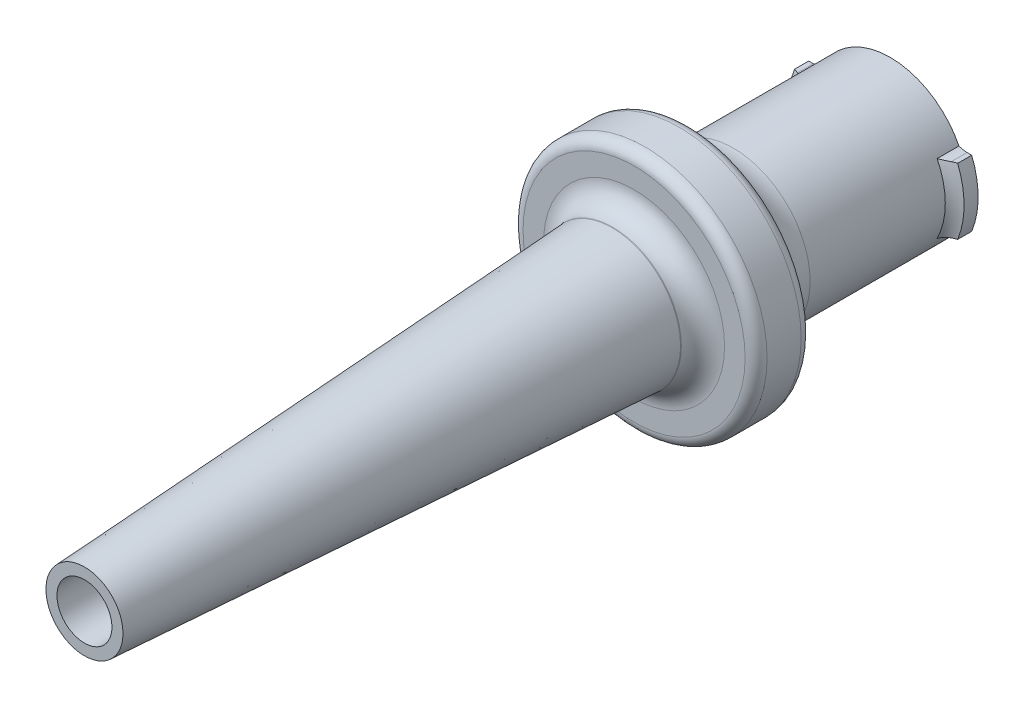
ISO-10303-21;
HEADER;
FILE_DESCRIPTION(('STEP AP214'),'2;1');
FILE_NAME('part.step','',(''),(''),'','','');
FILE_SCHEMA(('AUTOMOTIVE_DESIGN { 1 0 10303 214 1 1 1 1 }'));
ENDSEC;
DATA;
#1=APPLICATION_CONTEXT('core data for automotive mechanical design processes');
#2=APPLICATION_PROTOCOL_DEFINITION('international standard','automotive_design',2000,#1);
#3=PRODUCT_CONTEXT('',#1,'mechanical');
#4=PRODUCT('Part','Part','',(#3));
#5=PRODUCT_RELATED_PRODUCT_CATEGORY('part','',(#4));
#6=PRODUCT_DEFINITION_FORMATION('','',#4);
#7=PRODUCT_DEFINITION_CONTEXT('part definition',#1,'design');
#8=PRODUCT_DEFINITION('design','',#6,#7);
#9=PRODUCT_DEFINITION_SHAPE('','',#8);
#10=(LENGTH_UNIT() NAMED_UNIT(*) SI_UNIT(.MILLI.,.METRE.));
#11=(NAMED_UNIT(*) PLANE_ANGLE_UNIT() SI_UNIT($,.RADIAN.));
#12=(NAMED_UNIT(*) SI_UNIT($,.STERADIAN.) SOLID_ANGLE_UNIT());
#13=UNCERTAINTY_MEASURE_WITH_UNIT(LENGTH_MEASURE(1.E-05),#10,'distance_accuracy_value','');
#14=(GEOMETRIC_REPRESENTATION_CONTEXT(3) GLOBAL_UNCERTAINTY_ASSIGNED_CONTEXT((#13)) GLOBAL_UNIT_ASSIGNED_CONTEXT((#10,
#11,#12)) REPRESENTATION_CONTEXT('',''));
#15=CARTESIAN_POINT('',(0.,0.,0.));
#16=DIRECTION('',(0.,0.,1.));
#17=DIRECTION('',(1.,0.,0.));
#18=AXIS2_PLACEMENT_3D('',#15,#16,#17);
#19=CARTESIAN_POINT('',(0.,0.,12.65));
#20=DIRECTION('',(0.,0.,1.));
#21=DIRECTION('',(1.,0.,0.));
#22=AXIS2_PLACEMENT_3D('',#19,#20,#21);
#23=CYLINDRICAL_SURFACE('',#22,1.25);
#24=CARTESIAN_POINT('',(0.,0.,36.65));
#25=DIRECTION('',(0.,0.,1.));
#26=DIRECTION('',(1.,0.,0.));
#27=AXIS2_PLACEMENT_3D('',#24,#25,#26);
#28=CIRCLE('',#27,1.25);
#29=CARTESIAN_POINT('',(1.25,0.,36.65));
#30=VERTEX_POINT('',#29);
#31=EDGE_CURVE('E341',#30,#30,#28,.T.);
#32=ORIENTED_EDGE('',*,*,#31,.T.);
#33=EDGE_LOOP('',(#32));
#34=FACE_BOUND('',#33,.T.);
#35=CARTESIAN_POINT('',(0.,0.,13.));
#36=DIRECTION('',(0.,0.,-1.));
#37=DIRECTION('',(-1.,0.,0.));
#38=AXIS2_PLACEMENT_3D('',#35,#36,#37);
#39=CIRCLE('',#38,1.25);
#40=CARTESIAN_POINT('',(-1.25,0.,13.));
#41=VERTEX_POINT('',#40);
#42=EDGE_CURVE('E338',#41,#41,#39,.F.);
#43=ORIENTED_EDGE('',*,*,#42,.F.);
#44=EDGE_LOOP('',(#43));
#45=FACE_BOUND('',#44,.T.);
#46=ADVANCED_FACE('F36',(#34,#45),#23,.F.);
#47=CARTESIAN_POINT('',(0.,0.,11.65));
#48=DIRECTION('',(0.,0.,-1.));
#49=DIRECTION('',(1.,0.,0.));
#50=AXIS2_PLACEMENT_3D('',#47,#48,#49);
#51=CONICAL_SURFACE('',#50,3.15,0.0349065850398866);
#52=CARTESIAN_POINT('',(0.,0.,12.6151005032975));
#53=DIRECTION('',(0.,0.,1.));
#54=DIRECTION('',(1.,0.,0.));
#55=AXIS2_PLACEMENT_3D('',#52,#53,#54);
#56=CIRCLE('',#55,3.11629794778798);
#57=CARTESIAN_POINT('',(3.11629794778798,0.,12.6151005032975));
#58=VERTEX_POINT('',#57);
#59=EDGE_CURVE('E150',#58,#58,#56,.T.);
#60=ORIENTED_EDGE('',*,*,#59,.T.);
#61=EDGE_LOOP('',(#60));
#62=FACE_BOUND('',#61,.T.);
#63=CARTESIAN_POINT('',(0.,0.,12.65));
#64=DIRECTION('',(0.,0.,1.));
#65=DIRECTION('',(1.,0.,0.));
#66=AXIS2_PLACEMENT_3D('',#63,#64,#65);
#67=CIRCLE('',#66,3.11507923050825);
#68=CARTESIAN_POINT('',(3.11507923050825,0.,12.65));
#69=VERTEX_POINT('',#68);
#70=EDGE_CURVE('E348',#69,#69,#67,.T.);
#71=ORIENTED_EDGE('',*,*,#70,.F.);
#72=EDGE_LOOP('',(#71));
#73=FACE_BOUND('',#72,.T.);
#74=ADVANCED_FACE('F299',(#62,#73),#51,.T.);
#75=CARTESIAN_POINT('',(0.,0.,11.65));
#76=DIRECTION('',(0.,0.,1.));
#77=DIRECTION('',(1.,0.,0.));
#78=AXIS2_PLACEMENT_3D('',#75,#76,#77);
#79=PLANE('',#78);
#80=CARTESIAN_POINT('',(0.,0.,11.65));
#81=DIRECTION('',(0.,0.,1.));
#82=DIRECTION('',(1.,0.,0.));
#83=AXIS2_PLACEMENT_3D('',#80,#81,#82);
#84=CIRCLE('',#83,5.05);
#85=CARTESIAN_POINT('',(5.05,0.,11.65));
#86=VERTEX_POINT('',#85);
#87=EDGE_CURVE('E580',#86,#86,#84,.T.);
#88=ORIENTED_EDGE('',*,*,#87,.T.);
#89=EDGE_LOOP('',(#88));
#90=FACE_BOUND('',#89,.T.);
#91=CARTESIAN_POINT('',(0.,0.,11.65));
#92=DIRECTION('',(0.,0.,1.));
#93=DIRECTION('',(1.,0.,0.));
#94=AXIS2_PLACEMENT_3D('',#91,#92,#93);
#95=CIRCLE('',#94,4.11568877480708);
#96=CARTESIAN_POINT('',(4.11568877480708,0.,11.65));
#97=VERTEX_POINT('',#96);
#98=EDGE_CURVE('E585',#97,#97,#95,.F.);
#99=ORIENTED_EDGE('',*,*,#98,.T.);
#100=EDGE_LOOP('',(#99));
#101=FACE_BOUND('',#100,.T.);
#102=ADVANCED_FACE('F296',(#90,#101),#79,.T.);
#103=CARTESIAN_POINT('',(0.,1.5,0.64));
#104=DIRECTION('',(0.,-1.,0.));
#105=DIRECTION('',(1.,0.,0.));
#106=AXIS2_PLACEMENT_3D('',#103,#104,#105);
#107=PLANE('',#106);
#108=CARTESIAN_POINT('',(-3.70809924354783,1.5,0.64));
#109=CARTESIAN_POINT('',(-3.64737667205813,1.5,0.657679951316053));
#110=CARTESIAN_POINT('',(-3.58809548224564,1.5,0.680399848702581));
#111=CARTESIAN_POINT('',(-3.47390860919652,1.5,0.735387924779916));
#112=CARTESIAN_POINT('',(-3.4190177068852,1.5,0.767686765791125));
#113=CARTESIAN_POINT('',(-3.31544585192596,1.5,0.841230664962935));
#114=CARTESIAN_POINT('',(-3.26677378504799,1.5,0.882488301752746));
#115=CARTESIAN_POINT('',(-3.17759469637664,1.5,0.973008164892605));
#116=CARTESIAN_POINT('',(-3.1370786222244,1.5,1.02226140594474));
#117=CARTESIAN_POINT('',(-3.06807728624579,1.5,1.12455393615389));
#118=CARTESIAN_POINT('',(-3.03903954364431,1.5,1.17721947044101));
#119=CARTESIAN_POINT('',(-2.99144671397061,1.5,1.28706677175));
#120=CARTESIAN_POINT('',(-2.97287334553093,1.5,1.34424046246232));
#121=CARTESIAN_POINT('',(-2.9532436479617,1.5,1.43403388480849));
#122=CARTESIAN_POINT('',(-2.94805885931405,1.5,1.46579721780006));
#123=CARTESIAN_POINT('',(-2.94112879306822,1.5,1.52967914452873));
#124=CARTESIAN_POINT('',(-2.9393816875974,1.5,1.56179754033168));
#125=CARTESIAN_POINT('',(-2.93938769133994,1.5,1.59393920141697));
#126=B_SPLINE_CURVE_WITH_KNOTS('',3,(#108,#109,#110,#111,#112,#113,#114,#115,#116,#117,#118,
#119,#120,#121,#122,#123,#124,#125),.UNSPECIFIED.,.F.,.F.,(4,2,2,2,2,2,2,2,4),(0.,
0.189563466531215,0.379740400726355,0.570186100272554,0.76041924380344,0.939851108342601,
1.11896852379387,1.21535304129187,1.31168629569361),.UNSPECIFIED.);
#127=CARTESIAN_POINT('',(-3.70809924354783,1.5,0.64));
#128=VERTEX_POINT('',#127);
#129=CARTESIAN_POINT('',(-3.49857113690585,1.5,0.724151839840245));
#130=VERTEX_POINT('',#129);
#131=EDGE_CURVE('E187',#128,#130,#126,.T.);
#132=ORIENTED_EDGE('',*,*,#131,.T.);
#133=DIRECTION('',(0.,0.,-1.));
#134=VECTOR('',#133,1.);
#135=CARTESIAN_POINT('',(-3.49857113690718,1.5,0.64));
#136=LINE('',#135,#134);
#137=CARTESIAN_POINT('',(-3.49857113690718,1.5,0.));
#138=VERTEX_POINT('',#137);
#139=EDGE_CURVE('E374',#130,#138,#136,.T.);
#140=ORIENTED_EDGE('',*,*,#139,.T.);
#141=DIRECTION('',(-1.,0.,0.));
#142=VECTOR('',#141,1.);
#143=CARTESIAN_POINT('',(0.,1.5,0.));
#144=LINE('',#143,#142);
#145=CARTESIAN_POINT('',(-3.70809924354783,1.5,0.));
#146=VERTEX_POINT('',#145);
#147=EDGE_CURVE('E147',#138,#146,#144,.T.);
#148=ORIENTED_EDGE('',*,*,#147,.T.);
#149=DIRECTION('',(0.,0.,-1.));
#150=VECTOR('',#149,1.);
#151=CARTESIAN_POINT('',(-3.70809924354783,1.5,0.64));
#152=LINE('',#151,#150);
#153=EDGE_CURVE('E261',#128,#146,#152,.T.);
#154=ORIENTED_EDGE('',*,*,#153,.F.);
#155=EDGE_LOOP('',(#132,#140,#148,#154));
#156=FACE_BOUND('',#155,.T.);
#157=ADVANCED_FACE('F278',(#156),#107,.F.);
#158=CARTESIAN_POINT('',(0.,-1.5,0.64));
#159=DIRECTION('',(0.,-1.,0.));
#160=DIRECTION('',(1.,0.,0.));
#161=AXIS2_PLACEMENT_3D('',#158,#159,#160);
#162=PLANE('',#161);
#163=DIRECTION('',(-1.,0.,0.));
#164=VECTOR('',#163,1.);
#165=CARTESIAN_POINT('',(0.,-1.5,0.));
#166=LINE('',#165,#164);
#167=CARTESIAN_POINT('',(-3.49857113690718,-1.5,0.));
#168=VERTEX_POINT('',#167);
#169=CARTESIAN_POINT('',(-3.70809924354783,-1.5,0.));
#170=VERTEX_POINT('',#169);
#171=EDGE_CURVE('E251',#168,#170,#166,.T.);
#172=ORIENTED_EDGE('',*,*,#171,.F.);
#173=DIRECTION('',(0.,0.,1.));
#174=VECTOR('',#173,1.);
#175=CARTESIAN_POINT('',(-3.49857113690718,-1.5,1.59393920141695));
#176=LINE('',#175,#174);
#177=CARTESIAN_POINT('',(-3.49857113690718,-1.5,0.724151839839552));
#178=VERTEX_POINT('',#177);
#179=EDGE_CURVE('E367',#168,#178,#176,.T.);
#180=ORIENTED_EDGE('',*,*,#179,.T.);
#181=CARTESIAN_POINT('',(-2.93938769133981,-1.5,1.59393920141695));
#182=CARTESIAN_POINT('',(-2.93938571546912,-1.5,1.56781721229562));
#183=CARTESIAN_POINT('',(-2.94053765896739,-1.5,1.54170889725141));
#184=CARTESIAN_POINT('',(-2.94511887636671,-1.5,1.48970160424627));
#185=CARTESIAN_POINT('',(-2.94854737332306,-1.5,1.46380255791702));
#186=CARTESIAN_POINT('',(-2.96215986146523,-1.5,1.38690988271111));
#187=CARTESIAN_POINT('',(-2.97567150516193,-1.5,1.33646907387104));
#188=CARTESIAN_POINT('',(-3.01088785356483,-1.5,1.2386383549368));
#189=CARTESIAN_POINT('',(-3.03258513505815,-1.5,1.1912457260185));
#190=CARTESIAN_POINT('',(-3.08324366181701,-1.5,1.10049614193924));
#191=CARTESIAN_POINT('',(-3.11220966096846,-1.5,1.0571418534779));
#192=CARTESIAN_POINT('',(-3.17802550383664,-1.5,0.973209657344297));
#193=CARTESIAN_POINT('',(-3.21520602392207,-1.5,0.932891919895729));
#194=CARTESIAN_POINT('',(-3.29527356836177,-1.5,0.858348188677426));
#195=CARTESIAN_POINT('',(-3.33816567294797,-1.5,0.824127682257134));
#196=CARTESIAN_POINT('',(-3.43297836957665,-1.5,0.759282763278328));
#197=CARTESIAN_POINT('',(-3.48537244312384,-1.5,0.729350671013341));
#198=CARTESIAN_POINT('',(-3.59411743007106,-1.5,0.678107552693631));
#199=CARTESIAN_POINT('',(-3.65046170197082,-1.5,0.656782445138312));
#200=CARTESIAN_POINT('',(-3.70809924354783,-1.5,0.64));
#201=B_SPLINE_CURVE_WITH_KNOTS('',3,(#181,#182,#183,#184,#185,#186,#187,#188,#189,#190,#191,
#192,#193,#194,#195,#196,#197,#198,#199,#200),.UNSPECIFIED.,.F.,.F.,(4,2,2,2,2,2,2,2,2,4),(0.,
0.0783140176743149,0.156601321981189,0.312431311771733,0.468120324227024,0.623911426991152,
0.787773017702309,0.95178134278255,1.13204090642092,1.31200434824557),.UNSPECIFIED.);
#202=CARTESIAN_POINT('',(-3.70809924354783,-1.5,0.64));
#203=VERTEX_POINT('',#202);
#204=EDGE_CURVE('E179',#178,#203,#201,.T.);
#205=ORIENTED_EDGE('',*,*,#204,.T.);
#206=DIRECTION('',(0.,0.,-1.));
#207=VECTOR('',#206,1.);
#208=CARTESIAN_POINT('',(-3.70809924354783,-1.5,0.64));
#209=LINE('',#208,#207);
#210=EDGE_CURVE('E258',#203,#170,#209,.T.);
#211=ORIENTED_EDGE('',*,*,#210,.T.);
#212=EDGE_LOOP('',(#172,#180,#205,#211));
#213=FACE_BOUND('',#212,.T.);
#214=ADVANCED_FACE('F276',(#213),#162,.T.);
#215=CARTESIAN_POINT('',(3.70809924354783,1.5,0.));
#216=VERTEX_POINT('',#215);
#217=CARTESIAN_POINT('',(3.49857113690718,1.5,0.));
#218=VERTEX_POINT('',#217);
#219=EDGE_CURVE('E237',#216,#218,#144,.T.);
#220=ORIENTED_EDGE('',*,*,#219,.T.);
#221=DIRECTION('',(0.,0.,-1.));
#222=VECTOR('',#221,1.);
#223=CARTESIAN_POINT('',(3.49857113690718,1.5,0.64));
#224=LINE('',#223,#222);
#225=CARTESIAN_POINT('',(3.49857113690718,1.5,0.724151839839552));
#226=VERTEX_POINT('',#225);
#227=EDGE_CURVE('E357',#218,#226,#224,.F.);
#228=ORIENTED_EDGE('',*,*,#227,.T.);
#229=CARTESIAN_POINT('',(2.93938769133981,1.5,1.59393920141695));
#230=CARTESIAN_POINT('',(2.93938571546912,1.5,1.56781721229562));
#231=CARTESIAN_POINT('',(2.94053765896739,1.5,1.54170889725141));
#232=CARTESIAN_POINT('',(2.94511887636671,1.5,1.48970160424627));
#233=CARTESIAN_POINT('',(2.94854737332306,1.5,1.46380255791702));
#234=CARTESIAN_POINT('',(2.96215986146523,1.5,1.38690988271111));
#235=CARTESIAN_POINT('',(2.97567150516193,1.5,1.33646907387104));
#236=CARTESIAN_POINT('',(3.01088785356483,1.5,1.2386383549368));
#237=CARTESIAN_POINT('',(3.03258513505815,1.5,1.1912457260185));
#238=CARTESIAN_POINT('',(3.08324366181701,1.5,1.10049614193925));
#239=CARTESIAN_POINT('',(3.11220966096846,1.5,1.0571418534779));
#240=CARTESIAN_POINT('',(3.17802550383664,1.5,0.973209657344296));
#241=CARTESIAN_POINT('',(3.21520602392207,1.5,0.932891919895728));
#242=CARTESIAN_POINT('',(3.29527356836177,1.5,0.858348188677426));
#243=CARTESIAN_POINT('',(3.33816567294797,1.5,0.824127682257133));
#244=CARTESIAN_POINT('',(3.43297836957665,1.5,0.759282763278327));
#245=CARTESIAN_POINT('',(3.48537244312384,1.5,0.729350671013341));
#246=CARTESIAN_POINT('',(3.59411743007106,1.5,0.678107552693631));
#247=CARTESIAN_POINT('',(3.65046170197082,1.5,0.656782445138311));
#248=CARTESIAN_POINT('',(3.70809924354783,1.5,0.64));
#249=B_SPLINE_CURVE_WITH_KNOTS('',3,(#229,#230,#231,#232,#233,#234,#235,#236,#237,#238,#239,
#240,#241,#242,#243,#244,#245,#246,#247,#248),.UNSPECIFIED.,.F.,.F.,(4,2,2,2,2,2,2,2,2,4),(0.,
0.0783140176743151,0.156601321981189,0.312431311771733,0.468120324227024,0.623911426991152,
0.787773017702309,0.95178134278255,1.13204090642092,1.31200434824557),.UNSPECIFIED.);
#250=CARTESIAN_POINT('',(3.70809924354783,1.5,0.64));
#251=VERTEX_POINT('',#250);
#252=EDGE_CURVE('E264',#226,#251,#249,.T.);
#253=ORIENTED_EDGE('',*,*,#252,.T.);
#254=DIRECTION('',(0.,0.,-1.));
#255=VECTOR('',#254,1.);
#256=CARTESIAN_POINT('',(3.70809924354783,1.5,0.64));
#257=LINE('',#256,#255);
#258=EDGE_CURVE('E253',#251,#216,#257,.T.);
#259=ORIENTED_EDGE('',*,*,#258,.T.);
#260=EDGE_LOOP('',(#220,#228,#253,#259));
#261=FACE_BOUND('',#260,.T.);
#262=ADVANCED_FACE('F272',(#261),#107,.F.);
#263=CARTESIAN_POINT('',(0.,0.,0.64));
#264=DIRECTION('',(0.,0.,-1.));
#265=DIRECTION('',(-1.,0.,0.));
#266=AXIS2_PLACEMENT_3D('',#263,#264,#265);
#267=CYLINDRICAL_SURFACE('',#266,4.);
#268=CARTESIAN_POINT('',(0.,0.,0.));
#269=DIRECTION('',(0.,0.,1.));
#270=DIRECTION('',(1.,0.,0.));
#271=AXIS2_PLACEMENT_3D('',#268,#269,#270);
#272=CIRCLE('',#271,4.);
#273=EDGE_CURVE('E248',#146,#170,#272,.T.);
#274=ORIENTED_EDGE('',*,*,#273,.T.);
#275=ORIENTED_EDGE('',*,*,#210,.F.);
#276=CARTESIAN_POINT('',(0.,0.,0.64));
#277=DIRECTION('',(0.,0.,1.));
#278=DIRECTION('',(1.,0.,0.));
#279=AXIS2_PLACEMENT_3D('',#276,#277,#278);
#280=CIRCLE('',#279,4.);
#281=EDGE_CURVE('E242',#128,#203,#280,.T.);
#282=ORIENTED_EDGE('',*,*,#281,.F.);
#283=ORIENTED_EDGE('',*,*,#153,.T.);
#284=EDGE_LOOP('',(#274,#275,#282,#283));
#285=FACE_BOUND('',#284,.T.);
#286=ADVANCED_FACE('F275',(#285),#267,.T.);
#287=CARTESIAN_POINT('',(3.70809924354783,-1.5,0.64));
#288=CARTESIAN_POINT('',(3.64737667205813,-1.5,0.657679951316053));
#289=CARTESIAN_POINT('',(3.58809548224564,-1.5,0.680399848702581));
#290=CARTESIAN_POINT('',(3.47390860919652,-1.5,0.735387924779916));
#291=CARTESIAN_POINT('',(3.4190177068852,-1.5,0.767686765791125));
#292=CARTESIAN_POINT('',(3.31544585192596,-1.5,0.841230664962935));
#293=CARTESIAN_POINT('',(3.26677378504799,-1.5,0.882488301752746));
#294=CARTESIAN_POINT('',(3.17759469637664,-1.5,0.973008164892605));
#295=CARTESIAN_POINT('',(3.1370786222244,-1.5,1.02226140594474));
#296=CARTESIAN_POINT('',(3.06807728624579,-1.5,1.12455393615389));
#297=CARTESIAN_POINT('',(3.03903954364431,-1.5,1.17721947044101));
#298=CARTESIAN_POINT('',(2.99144671397061,-1.5,1.28706677175));
#299=CARTESIAN_POINT('',(2.97287334553093,-1.5,1.34424046246232));
#300=CARTESIAN_POINT('',(2.9532436479617,-1.5,1.43403388480849));
#301=CARTESIAN_POINT('',(2.94805885931405,-1.5,1.46579721780006));
#302=CARTESIAN_POINT('',(2.94112879306822,-1.5,1.52967914452873));
#303=CARTESIAN_POINT('',(2.9393816875974,-1.5,1.56179754033168));
#304=CARTESIAN_POINT('',(2.93938769133994,-1.5,1.59393920141697));
#305=B_SPLINE_CURVE_WITH_KNOTS('',3,(#287,#288,#289,#290,#291,#292,#293,#294,#295,#296,#297,
#298,#299,#300,#301,#302,#303,#304),.UNSPECIFIED.,.F.,.F.,(4,2,2,2,2,2,2,2,4),(0.,
0.189563466531215,0.379740400726355,0.570186100272554,0.760419243803441,0.939851108342601,
1.11896852379387,1.21535304129187,1.31168629569362),.UNSPECIFIED.);
#306=CARTESIAN_POINT('',(3.70809924354783,-1.5,0.64));
#307=VERTEX_POINT('',#306);
#308=CARTESIAN_POINT('',(3.49857113690585,-1.5,0.724151839840245));
#309=VERTEX_POINT('',#308);
#310=EDGE_CURVE('E268',#307,#309,#305,.T.);
#311=ORIENTED_EDGE('',*,*,#310,.T.);
#312=DIRECTION('',(0.,0.,1.));
#313=VECTOR('',#312,1.);
#314=CARTESIAN_POINT('',(3.49857113690718,-1.5,0.));
#315=LINE('',#314,#313);
#316=CARTESIAN_POINT('',(3.49857113690718,-1.5,0.));
#317=VERTEX_POINT('',#316);
#318=EDGE_CURVE('E233',#309,#317,#315,.F.);
#319=ORIENTED_EDGE('',*,*,#318,.T.);
#320=CARTESIAN_POINT('',(3.70809924354783,-1.5,0.));
#321=VERTEX_POINT('',#320);
#322=EDGE_CURVE('E229',#321,#317,#166,.T.);
#323=ORIENTED_EDGE('',*,*,#322,.F.);
#324=DIRECTION('',(0.,0.,-1.));
#325=VECTOR('',#324,1.);
#326=CARTESIAN_POINT('',(3.70809924354783,-1.5,0.64));
#327=LINE('',#326,#325);
#328=EDGE_CURVE('E256',#307,#321,#327,.T.);
#329=ORIENTED_EDGE('',*,*,#328,.F.);
#330=EDGE_LOOP('',(#311,#319,#323,#329));
#331=FACE_BOUND('',#330,.T.);
#332=ADVANCED_FACE('F279',(#331),#162,.T.);
#333=EDGE_CURVE('E245',#321,#216,#272,.T.);
#334=ORIENTED_EDGE('',*,*,#333,.T.);
#335=ORIENTED_EDGE('',*,*,#258,.F.);
#336=EDGE_CURVE('E244',#307,#251,#280,.T.);
#337=ORIENTED_EDGE('',*,*,#336,.F.);
#338=ORIENTED_EDGE('',*,*,#328,.T.);
#339=EDGE_LOOP('',(#334,#335,#337,#338));
#340=FACE_BOUND('',#339,.T.);
#341=ADVANCED_FACE('F284',(#340),#267,.T.);
#342=CARTESIAN_POINT('',(0.,0.,0.));
#343=DIRECTION('',(0.,0.,1.));
#344=DIRECTION('',(1.,0.,0.));
#345=AXIS2_PLACEMENT_3D('',#342,#343,#344);
#346=PLANE('',#345);
#347=CARTESIAN_POINT('',(3.49857113690718,-2.5,0.));
#348=DIRECTION('',(0.,0.,1.));
#349=DIRECTION('',(1.,0.,0.));
#350=AXIS2_PLACEMENT_3D('',#347,#348,#349);
#351=CIRCLE('',#350,1.);
#352=CARTESIAN_POINT('',(3.12739192469194,-1.57143875139048,0.));
#353=VERTEX_POINT('',#352);
#354=EDGE_CURVE('E207',#317,#353,#351,.T.);
#355=ORIENTED_EDGE('',*,*,#354,.T.);
#356=CARTESIAN_POINT('',(0.,0.,0.));
#357=DIRECTION('',(0.,0.,-1.));
#358=DIRECTION('',(-1.,0.,0.));
#359=AXIS2_PLACEMENT_3D('',#356,#357,#358);
#360=CIRCLE('',#359,3.5);
#361=CARTESIAN_POINT('',(-3.12739192469194,-1.57143875139048,0.));
#362=VERTEX_POINT('',#361);
#363=EDGE_CURVE('E136',#353,#362,#360,.T.);
#364=ORIENTED_EDGE('',*,*,#363,.T.);
#365=CARTESIAN_POINT('',(-3.49857113690718,-2.5,0.));
#366=DIRECTION('',(0.,0.,1.));
#367=DIRECTION('',(1.,0.,0.));
#368=AXIS2_PLACEMENT_3D('',#365,#366,#367);
#369=CIRCLE('',#368,1.);
#370=EDGE_CURVE('E201',#362,#168,#369,.T.);
#371=ORIENTED_EDGE('',*,*,#370,.T.);
#372=ORIENTED_EDGE('',*,*,#171,.T.);
#373=ORIENTED_EDGE('',*,*,#273,.F.);
#374=ORIENTED_EDGE('',*,*,#147,.F.);
#375=CARTESIAN_POINT('',(-3.49857113690718,2.5,0.));
#376=DIRECTION('',(0.,0.,1.));
#377=DIRECTION('',(1.,0.,0.));
#378=AXIS2_PLACEMENT_3D('',#375,#376,#377);
#379=CIRCLE('',#378,1.);
#380=CARTESIAN_POINT('',(-3.12739192469194,1.57143875139048,0.));
#381=VERTEX_POINT('',#380);
#382=EDGE_CURVE('E51',#138,#381,#379,.T.);
#383=ORIENTED_EDGE('',*,*,#382,.T.);
#384=CARTESIAN_POINT('',(3.12739192469194,1.57143875139048,0.));
#385=VERTEX_POINT('',#384);
#386=EDGE_CURVE('E128',#381,#385,#360,.T.);
#387=ORIENTED_EDGE('',*,*,#386,.T.);
#388=CARTESIAN_POINT('',(3.49857113690718,2.5,0.));
#389=DIRECTION('',(0.,0.,1.));
#390=DIRECTION('',(1.,0.,0.));
#391=AXIS2_PLACEMENT_3D('',#388,#389,#390);
#392=CIRCLE('',#391,1.);
#393=EDGE_CURVE('E148',#385,#218,#392,.T.);
#394=ORIENTED_EDGE('',*,*,#393,.T.);
#395=ORIENTED_EDGE('',*,*,#219,.F.);
#396=ORIENTED_EDGE('',*,*,#333,.F.);
#397=ORIENTED_EDGE('',*,*,#322,.T.);
#398=EDGE_LOOP('',(#355,#364,#371,#372,#373,#374,#383,#387,#394,#395,#396,#397));
#399=FACE_BOUND('',#398,.T.);
#400=CARTESIAN_POINT('',(0.,0.,0.));
#401=DIRECTION('',(0.,0.,-1.));
#402=DIRECTION('',(-1.,0.,0.));
#403=AXIS2_PLACEMENT_3D('',#400,#401,#402);
#404=CIRCLE('',#403,2.5);
#405=CARTESIAN_POINT('',(-2.5,0.,0.));
#406=VERTEX_POINT('',#405);
#407=EDGE_CURVE('E349',#406,#406,#404,.T.);
#408=ORIENTED_EDGE('',*,*,#407,.F.);
#409=EDGE_LOOP('',(#408));
#410=FACE_BOUND('',#409,.T.);
#411=ADVANCED_FACE('F144',(#399,#410),#346,.F.);
#412=CARTESIAN_POINT('',(0.,0.,11.65));
#413=DIRECTION('',(0.,0.,-1.));
#414=DIRECTION('',(-1.,0.,0.));
#415=AXIS2_PLACEMENT_3D('',#412,#413,#414);
#416=CYLINDRICAL_SURFACE('',#415,5.55);
#417=CARTESIAN_POINT('',(0.,0.,11.15));
#418=DIRECTION('',(0.,0.,1.));
#419=DIRECTION('',(1.,0.,0.));
#420=AXIS2_PLACEMENT_3D('',#417,#418,#419);
#421=CIRCLE('',#420,5.55);
#422=CARTESIAN_POINT('',(5.55,0.,11.15));
#423=VERTEX_POINT('',#422);
#424=EDGE_CURVE('E140',#423,#423,#421,.F.);
#425=ORIENTED_EDGE('',*,*,#424,.T.);
#426=EDGE_LOOP('',(#425));
#427=FACE_BOUND('',#426,.T.);
#428=CARTESIAN_POINT('',(0.,0.,9.6));
#429=DIRECTION('',(0.,0.,1.));
#430=DIRECTION('',(1.,0.,0.));
#431=AXIS2_PLACEMENT_3D('',#428,#429,#430);
#432=CIRCLE('',#431,5.55);
#433=CARTESIAN_POINT('',(5.55,0.,9.6));
#434=VERTEX_POINT('',#433);
#435=EDGE_CURVE('E578',#434,#434,#432,.T.);
#436=ORIENTED_EDGE('',*,*,#435,.T.);
#437=EDGE_LOOP('',(#436));
#438=FACE_BOUND('',#437,.T.);
#439=ADVANCED_FACE('F292',(#427,#438),#416,.T.);
#440=CARTESIAN_POINT('',(0.,0.,1.59393920141695));
#441=DIRECTION('',(0.,0.,-1.));
#442=DIRECTION('',(-1.,0.,0.));
#443=AXIS2_PLACEMENT_3D('',#440,#441,#442);
#444=TOROIDAL_SURFACE('',#443,4.3,1.);
#445=CARTESIAN_POINT('',(3.49857113690718,1.5,0.724151839839552));
#446=CARTESIAN_POINT('',(3.46813238076463,1.50000371026191,0.740022002745085));
#447=CARTESIAN_POINT('',(3.43832885012181,1.50138889751431,0.757002467372123));
#448=CARTESIAN_POINT('',(3.38016749193705,1.50660567330888,0.792807090686246));
#449=CARTESIAN_POINT('',(3.35180631994227,1.51043129499536,0.811626657997318));
#450=CARTESIAN_POINT('',(3.2694823168231,1.5250097539399,0.870014868642405));
#451=CARTESIAN_POINT('',(3.217668472291,1.53887712505026,0.911843001837392));
#452=CARTESIAN_POINT('',(3.1001483457144,1.57990816679971,1.01723049055714));
#453=CARTESIAN_POINT('',(3.03732643341468,1.61018312501245,1.08272491751646));
#454=CARTESIAN_POINT('',(2.92216470450621,1.68005660911412,1.21818023460511));
#455=CARTESIAN_POINT('',(2.86987358127555,1.71969668424737,1.28815998587926));
#456=CARTESIAN_POINT('',(2.79719714460234,1.78637992885264,1.3970891145051));
#457=CARTESIAN_POINT('',(2.77325880206341,1.81074362010599,1.43538411133335));
#458=CARTESIAN_POINT('',(2.72821355060894,1.86148701447727,1.51218320861839));
#459=CARTESIAN_POINT('',(2.70710087479049,1.88786243353957,1.55068671100862));
#460=CARTESIAN_POINT('',(2.68656761926378,1.91634581692431,1.59076771051939));
#461=CARTESIAN_POINT('',(2.68575759968316,1.91747440336897,1.59235346830425));
#462=CARTESIAN_POINT('',(2.6849499422776,1.91860465116279,1.59393920141695));
#463=B_SPLINE_CURVE_WITH_KNOTS('',3,(#445,#446,#447,#448,#449,#450,#451,#452,#453,#454,#455,
#456,#457,#458,#459,#460,#461,#462),.UNSPECIFIED.,.F.,.F.,(4,2,2,2,2,2,2,2,4),(0.,
0.102854308744296,0.205458097838275,0.408615458041143,0.69413860693505,0.980953117040051,
1.13480324458699,1.28833442888432,1.29465899016649),.UNSPECIFIED.);
#464=CARTESIAN_POINT('',(3.12739192469194,1.57143875139048,0.993939201403987));
#465=VERTEX_POINT('',#464);
#466=EDGE_CURVE('E152',#226,#465,#463,.T.);
#467=ORIENTED_EDGE('',*,*,#466,.T.);
#468=CARTESIAN_POINT('',(0.,0.,0.993939201416945));
#469=DIRECTION('',(0.,0.,1.));
#470=DIRECTION('',(1.,0.,0.));
#471=AXIS2_PLACEMENT_3D('',#468,#469,#470);
#472=CIRCLE('',#471,3.5);
#473=CARTESIAN_POINT('',(3.12739192469194,-1.57143875139048,0.993939201416945));
#474=VERTEX_POINT('',#473);
#475=EDGE_CURVE('E235',#465,#474,#472,.F.);
#476=ORIENTED_EDGE('',*,*,#475,.T.);
#477=CARTESIAN_POINT('',(3.49857113690718,-1.5,0.724151839840245));
#478=CARTESIAN_POINT('',(3.46813238076444,-1.50000371026192,0.74002200274545));
#479=CARTESIAN_POINT('',(3.43832885012154,-1.50138889751433,0.757002467372354));
#480=CARTESIAN_POINT('',(3.38016749193673,-1.50660567330891,0.792807090686382));
#481=CARTESIAN_POINT('',(3.35180631994197,-1.5104312949954,0.811626657997493));
#482=CARTESIAN_POINT('',(3.26948231682286,-1.52500975393996,0.87001486864265));
#483=CARTESIAN_POINT('',(3.21766847229075,-1.53887712505034,0.911843001837619));
#484=CARTESIAN_POINT('',(3.10014834571414,-1.57990816679982,1.01723049055737));
#485=CARTESIAN_POINT('',(3.03732643341441,-1.6101831250126,1.0827249175167));
#486=CARTESIAN_POINT('',(2.92216470450598,-1.68005660911427,1.21818023460547));
#487=CARTESIAN_POINT('',(2.86987358127537,-1.71969668424748,1.28815998587971));
#488=CARTESIAN_POINT('',(2.79719714460211,-1.78637992885288,1.39708911450536));
#489=CARTESIAN_POINT('',(2.77325880206315,-1.8107436201063,1.43538411133343));
#490=CARTESIAN_POINT('',(2.72821355060898,-1.8614870144772,1.51218320861867));
#491=CARTESIAN_POINT('',(2.70710087479085,-1.88786243353907,1.55068671100927));
#492=CARTESIAN_POINT('',(2.68656761926381,-1.91634581692427,1.59076771051944));
#493=CARTESIAN_POINT('',(2.68575759968318,-1.91747440336895,1.59235346830428));
#494=CARTESIAN_POINT('',(2.6849499422776,-1.91860465116279,1.59393920141695));
#495=B_SPLINE_CURVE_WITH_KNOTS('',3,(#477,#478,#479,#480,#481,#482,#483,#484,#485,#486,#487,
#488,#489,#490,#491,#492,#493,#494),.UNSPECIFIED.,.F.,.F.,(4,2,2,2,2,2,2,2,4),(0.,
0.102854308744308,0.205458097838278,0.408615458041137,0.694138606935125,0.980953117040202,
1.13480324458689,1.28833442888398,1.29465899016615),.UNSPECIFIED.);
#496=EDGE_CURVE('E200',#474,#309,#495,.F.);
#497=ORIENTED_EDGE('',*,*,#496,.T.);
#498=ORIENTED_EDGE('',*,*,#310,.F.);
#499=ORIENTED_EDGE('',*,*,#336,.T.);
#500=ORIENTED_EDGE('',*,*,#252,.F.);
#501=EDGE_LOOP('',(#467,#476,#497,#498,#499,#500));
#502=FACE_BOUND('',#501,.T.);
#503=ADVANCED_FACE('F171',(#502),#444,.F.);
#504=CARTESIAN_POINT('',(0.,0.,1.59393920141695));
#505=DIRECTION('',(0.,0.,-1.));
#506=DIRECTION('',(-1.,0.,0.));
#507=AXIS2_PLACEMENT_3D('',#504,#505,#506);
#508=TOROIDAL_SURFACE('',#507,4.3,1.);
#509=CARTESIAN_POINT('',(-3.49857113690718,-1.5,0.724151839839552));
#510=CARTESIAN_POINT('',(-3.46813238076464,-1.50000371026191,0.740022002745084));
#511=CARTESIAN_POINT('',(-3.43832885012182,-1.50138889751431,0.75700246737212));
#512=CARTESIAN_POINT('',(-3.38016749193706,-1.50660567330888,0.792807090686238));
#513=CARTESIAN_POINT('',(-3.35180631994228,-1.51043129499536,0.811626657997308));
#514=CARTESIAN_POINT('',(-3.26948231682312,-1.5250097539399,0.870014868642398));
#515=CARTESIAN_POINT('',(-3.217668472291,-1.53887712505026,0.911843001837391));
#516=CARTESIAN_POINT('',(-3.10014834571439,-1.57990816679971,1.01723049055714));
#517=CARTESIAN_POINT('',(-3.03732643341466,-1.61018312501247,1.08272491751644));
#518=CARTESIAN_POINT('',(-2.92216470450622,-1.6800566091141,1.21818023460515));
#519=CARTESIAN_POINT('',(-2.86987358127562,-1.71969668424728,1.28815998587937));
#520=CARTESIAN_POINT('',(-2.79719714460231,-1.78637992885269,1.39708911450505));
#521=CARTESIAN_POINT('',(-2.7732588020633,-1.81074362010613,1.43538411133319));
#522=CARTESIAN_POINT('',(-2.72821355060905,-1.86148701447712,1.51218320861855));
#523=CARTESIAN_POINT('',(-2.70710087479088,-1.88786243353903,1.5506867110092));
#524=CARTESIAN_POINT('',(-2.68656761926381,-1.91634581692427,1.59076771051944));
#525=CARTESIAN_POINT('',(-2.68575759968317,-1.91747440336895,1.59235346830428));
#526=CARTESIAN_POINT('',(-2.6849499422776,-1.91860465116279,1.59393920141695));
#527=B_SPLINE_CURVE_WITH_KNOTS('',3,(#509,#510,#511,#512,#513,#514,#515,#516,#517,#518,#519,
#520,#521,#522,#523,#524,#525,#526),.UNSPECIFIED.,.F.,.F.,(4,2,2,2,2,2,2,2,4),(0.,
0.102854308744286,0.205458097838253,0.408615458041143,0.69413860693506,0.980953117040049,
1.13480324458699,1.28833442888432,1.29465899016649),.UNSPECIFIED.);
#528=CARTESIAN_POINT('',(-3.12739192469194,-1.57143875139048,0.993939201416945));
#529=VERTEX_POINT('',#528);
#530=EDGE_CURVE('E193',#178,#529,#527,.T.);
#531=ORIENTED_EDGE('',*,*,#530,.T.);
#532=CARTESIAN_POINT('',(0.,0.,0.993939201416945));
#533=DIRECTION('',(0.,0.,1.));
#534=DIRECTION('',(1.,0.,0.));
#535=AXIS2_PLACEMENT_3D('',#532,#533,#534);
#536=CIRCLE('',#535,3.5);
#537=CARTESIAN_POINT('',(-3.12739192469194,1.57143875139048,0.993939201403405));
#538=VERTEX_POINT('',#537);
#539=EDGE_CURVE('E135',#529,#538,#536,.F.);
#540=ORIENTED_EDGE('',*,*,#539,.T.);
#541=CARTESIAN_POINT('',(-3.49857113690718,1.5,0.724151839840245));
#542=CARTESIAN_POINT('',(-3.46813238076443,1.50000371026192,0.740022002745453));
#543=CARTESIAN_POINT('',(-3.43832885012152,1.50138889751433,0.757002467372362));
#544=CARTESIAN_POINT('',(-3.3801674919367,1.50660567330891,0.792807090686401));
#545=CARTESIAN_POINT('',(-3.35180631994194,1.51043129499541,0.811626657997519));
#546=CARTESIAN_POINT('',(-3.26948231682283,1.52500975393997,0.870014868642669));
#547=CARTESIAN_POINT('',(-3.21766847229073,1.53887712505035,0.91184300183762));
#548=CARTESIAN_POINT('',(-3.10014834571415,1.5799081667998,1.01723049055737));
#549=CARTESIAN_POINT('',(-3.03732643341447,1.61018312501254,1.08272491751675));
#550=CARTESIAN_POINT('',(-2.92216470450595,1.68005660911432,1.21818023460539));
#551=CARTESIAN_POINT('',(-2.86987358127522,1.7196966842477,1.28815998587946));
#552=CARTESIAN_POINT('',(-2.7971971446022,1.78637992885276,1.39708911450549));
#553=CARTESIAN_POINT('',(-2.77325880206341,1.81074362010594,1.43538411133381));
#554=CARTESIAN_POINT('',(-2.72821355060873,1.86148701447755,1.51218320861829));
#555=CARTESIAN_POINT('',(-2.70710087478993,1.88786243354035,1.55068671100788));
#556=CARTESIAN_POINT('',(-2.68656761926374,1.91634581692437,1.59076771051932));
#557=CARTESIAN_POINT('',(-2.68575759968314,1.917474403369,1.59235346830422));
#558=CARTESIAN_POINT('',(-2.6849499422776,1.91860465116279,1.59393920141695));
#559=B_SPLINE_CURVE_WITH_KNOTS('',3,(#541,#542,#543,#544,#545,#546,#547,#548,#549,#550,#551,
#552,#553,#554,#555,#556,#557,#558),.UNSPECIFIED.,.F.,.F.,(4,2,2,2,2,2,2,2,4),(0.,
0.102854308744334,0.205458097838331,0.408615458041137,0.694138606935095,0.980953117040202,
1.1348032445869,1.28833442888398,1.29465899016615),.UNSPECIFIED.);
#560=EDGE_CURVE('E59',#538,#130,#559,.F.);
#561=ORIENTED_EDGE('',*,*,#560,.T.);
#562=ORIENTED_EDGE('',*,*,#131,.F.);
#563=ORIENTED_EDGE('',*,*,#281,.T.);
#564=ORIENTED_EDGE('',*,*,#204,.F.);
#565=EDGE_LOOP('',(#531,#540,#561,#562,#563,#564));
#566=FACE_BOUND('',#565,.T.);
#567=ADVANCED_FACE('F165',(#566),#508,.F.);
#568=CARTESIAN_POINT('',(-3.49857113690718,-2.5,9.1));
#569=DIRECTION('',(0.,0.,-1.));
#570=DIRECTION('',(-1.,0.,0.));
#571=AXIS2_PLACEMENT_3D('',#568,#569,#570);
#572=CYLINDRICAL_SURFACE('',#571,1.);
#573=ORIENTED_EDGE('',*,*,#370,.F.);
#574=DIRECTION('',(0.,0.,-1.));
#575=VECTOR('',#574,1.);
#576=CARTESIAN_POINT('',(-3.12739192469194,-1.57143875139048,4.5));
#577=LINE('',#576,#575);
#578=EDGE_CURVE('E353',#362,#529,#577,.F.);
#579=ORIENTED_EDGE('',*,*,#578,.T.);
#580=ORIENTED_EDGE('',*,*,#530,.F.);
#581=ORIENTED_EDGE('',*,*,#179,.F.);
#582=EDGE_LOOP('',(#573,#579,#580,#581));
#583=FACE_BOUND('',#582,.T.);
#584=ADVANCED_FACE('F170',(#583),#572,.F.);
#585=CARTESIAN_POINT('',(3.49857113690718,-2.5,9.1));
#586=DIRECTION('',(0.,0.,-1.));
#587=DIRECTION('',(-1.,0.,0.));
#588=AXIS2_PLACEMENT_3D('',#585,#586,#587);
#589=CYLINDRICAL_SURFACE('',#588,1.);
#590=ORIENTED_EDGE('',*,*,#496,.F.);
#591=DIRECTION('',(0.,0.,-1.));
#592=VECTOR('',#591,1.);
#593=CARTESIAN_POINT('',(3.12739192469194,-1.57143875139048,4.5));
#594=LINE('',#593,#592);
#595=EDGE_CURVE('E234',#474,#353,#594,.T.);
#596=ORIENTED_EDGE('',*,*,#595,.T.);
#597=ORIENTED_EDGE('',*,*,#354,.F.);
#598=ORIENTED_EDGE('',*,*,#318,.F.);
#599=EDGE_LOOP('',(#590,#596,#597,#598));
#600=FACE_BOUND('',#599,.T.);
#601=ADVANCED_FACE('F208',(#600),#589,.F.);
#602=CARTESIAN_POINT('',(3.49857113690718,2.5,9.1));
#603=DIRECTION('',(0.,0.,-1.));
#604=DIRECTION('',(-1.,0.,0.));
#605=AXIS2_PLACEMENT_3D('',#602,#603,#604);
#606=CYLINDRICAL_SURFACE('',#605,1.);
#607=ORIENTED_EDGE('',*,*,#393,.F.);
#608=DIRECTION('',(0.,0.,-1.));
#609=VECTOR('',#608,1.);
#610=CARTESIAN_POINT('',(3.12739192469194,1.57143875139048,4.5));
#611=LINE('',#610,#609);
#612=EDGE_CURVE('E132',#385,#465,#611,.F.);
#613=ORIENTED_EDGE('',*,*,#612,.T.);
#614=ORIENTED_EDGE('',*,*,#466,.F.);
#615=ORIENTED_EDGE('',*,*,#227,.F.);
#616=EDGE_LOOP('',(#607,#613,#614,#615));
#617=FACE_BOUND('',#616,.T.);
#618=ADVANCED_FACE('F211',(#617),#606,.F.);
#619=CARTESIAN_POINT('',(-3.49857113690718,2.5,9.1));
#620=DIRECTION('',(0.,0.,-1.));
#621=DIRECTION('',(-1.,0.,0.));
#622=AXIS2_PLACEMENT_3D('',#619,#620,#621);
#623=CYLINDRICAL_SURFACE('',#622,1.);
#624=ORIENTED_EDGE('',*,*,#560,.F.);
#625=DIRECTION('',(0.,0.,-1.));
#626=VECTOR('',#625,1.);
#627=CARTESIAN_POINT('',(-3.12739192469194,1.57143875139048,4.5));
#628=LINE('',#627,#626);
#629=EDGE_CURVE('E130',#538,#381,#628,.T.);
#630=ORIENTED_EDGE('',*,*,#629,.T.);
#631=ORIENTED_EDGE('',*,*,#382,.F.);
#632=ORIENTED_EDGE('',*,*,#139,.F.);
#633=EDGE_LOOP('',(#624,#630,#631,#632));
#634=FACE_BOUND('',#633,.T.);
#635=ADVANCED_FACE('F138',(#634),#623,.F.);
#636=CARTESIAN_POINT('',(0.,0.,12.65));
#637=DIRECTION('',(0.,0.,1.));
#638=DIRECTION('',(1.,0.,0.));
#639=AXIS2_PLACEMENT_3D('',#636,#637,#638);
#640=TOROIDAL_SURFACE('',#639,4.11568877480708,1.);
#641=ORIENTED_EDGE('',*,*,#98,.F.);
#642=EDGE_LOOP('',(#641));
#643=FACE_BOUND('',#642,.T.);
#644=ORIENTED_EDGE('',*,*,#59,.F.);
#645=EDGE_LOOP('',(#644));
#646=FACE_BOUND('',#645,.T.);
#647=ADVANCED_FACE('F441',(#643,#646),#640,.F.);
#648=CARTESIAN_POINT('',(0.,0.,11.15));
#649=DIRECTION('',(0.,0.,1.));
#650=DIRECTION('',(1.,0.,0.));
#651=AXIS2_PLACEMENT_3D('',#648,#649,#650);
#652=TOROIDAL_SURFACE('',#651,5.05,0.5);
#653=ORIENTED_EDGE('',*,*,#424,.F.);
#654=EDGE_LOOP('',(#653));
#655=FACE_BOUND('',#654,.T.);
#656=ORIENTED_EDGE('',*,*,#87,.F.);
#657=EDGE_LOOP('',(#656));
#658=FACE_BOUND('',#657,.T.);
#659=ADVANCED_FACE('F447',(#655,#658),#652,.T.);
#660=CARTESIAN_POINT('',(0.,0.,9.6));
#661=DIRECTION('',(0.,0.,1.));
#662=DIRECTION('',(1.,0.,0.));
#663=AXIS2_PLACEMENT_3D('',#660,#661,#662);
#664=TOROIDAL_SURFACE('',#663,5.05,0.5);
#665=CARTESIAN_POINT('',(0.,0.,9.10816669490552));
#666=DIRECTION('',(0.,0.,1.));
#667=DIRECTION('',(1.,0.,0.));
#668=AXIS2_PLACEMENT_3D('',#665,#666,#667);
#669=CIRCLE('',#668,5.14000000000002);
#670=CARTESIAN_POINT('',(5.14000000000002,0.,9.10816669490552));
#671=VERTEX_POINT('',#670);
#672=EDGE_CURVE('E139',#671,#671,#669,.T.);
#673=ORIENTED_EDGE('',*,*,#672,.T.);
#674=EDGE_LOOP('',(#673));
#675=FACE_BOUND('',#674,.T.);
#676=ORIENTED_EDGE('',*,*,#435,.F.);
#677=EDGE_LOOP('',(#676));
#678=FACE_BOUND('',#677,.T.);
#679=ADVANCED_FACE('F313',(#675,#678),#664,.T.);
#680=CARTESIAN_POINT('',(0.,0.,9.));
#681=DIRECTION('',(0.,0.,-1.));
#682=DIRECTION('',(-1.,0.,0.));
#683=AXIS2_PLACEMENT_3D('',#680,#681,#682);
#684=CYLINDRICAL_SURFACE('',#683,3.5);
#685=CARTESIAN_POINT('',(0.,0.,7.14083347452834));
#686=DIRECTION('',(0.,0.,1.));
#687=DIRECTION('',(1.,0.,0.));
#688=AXIS2_PLACEMENT_3D('',#685,#686,#687);
#689=CIRCLE('',#688,3.5);
#690=CARTESIAN_POINT('',(3.5,0.,7.14083347452834));
#691=VERTEX_POINT('',#690);
#692=EDGE_CURVE('E44',#691,#691,#689,.F.);
#693=ORIENTED_EDGE('',*,*,#692,.T.);
#694=EDGE_LOOP('',(#693));
#695=FACE_BOUND('',#694,.T.);
#696=ORIENTED_EDGE('',*,*,#595,.F.);
#697=ORIENTED_EDGE('',*,*,#475,.F.);
#698=ORIENTED_EDGE('',*,*,#612,.F.);
#699=ORIENTED_EDGE('',*,*,#386,.F.);
#700=ORIENTED_EDGE('',*,*,#629,.F.);
#701=ORIENTED_EDGE('',*,*,#539,.F.);
#702=ORIENTED_EDGE('',*,*,#578,.F.);
#703=ORIENTED_EDGE('',*,*,#363,.F.);
#704=EDGE_LOOP('',(#696,#697,#698,#699,#700,#701,#702,#703));
#705=FACE_BOUND('',#704,.T.);
#706=ADVANCED_FACE('F129',(#695,#705),#684,.T.);
#707=CARTESIAN_POINT('',(0.,0.,0.));
#708=DIRECTION('',(0.,0.,-1.));
#709=DIRECTION('',(-1.,0.,0.));
#710=AXIS2_PLACEMENT_3D('',#707,#708,#709);
#711=CONICAL_SURFACE('',#710,2.5,0.0436332312998583);
#712=CARTESIAN_POINT('',(0.,0.,9.));
#713=DIRECTION('',(0.,0.,-1.));
#714=DIRECTION('',(-1.,0.,0.));
#715=AXIS2_PLACEMENT_3D('',#712,#713,#714);
#716=CIRCLE('',#715,2.10705151382339);
#717=CARTESIAN_POINT('',(-2.10705151382339,0.,9.));
#718=VERTEX_POINT('',#717);
#719=EDGE_CURVE('E337',#718,#718,#716,.T.);
#720=ORIENTED_EDGE('',*,*,#719,.F.);
#721=EDGE_LOOP('',(#720));
#722=FACE_BOUND('',#721,.T.);
#723=ORIENTED_EDGE('',*,*,#407,.T.);
#724=EDGE_LOOP('',(#723));
#725=FACE_BOUND('',#724,.T.);
#726=ADVANCED_FACE('F312',(#722,#725),#711,.F.);
#727=CARTESIAN_POINT('',(0.,0.,12.65));
#728=DIRECTION('',(0.,0.,-1.));
#729=DIRECTION('',(1.,0.,0.));
#730=AXIS2_PLACEMENT_3D('',#727,#728,#729);
#731=CONICAL_SURFACE('',#730,3.11507923050825,0.0567232006898158);
#732=CARTESIAN_POINT('',(0.,0.,36.65));
#733=DIRECTION('',(0.,0.,1.));
#734=DIRECTION('',(1.,0.,0.));
#735=AXIS2_PLACEMENT_3D('',#732,#733,#734);
#736=CIRCLE('',#735,1.75226046744556);
#737=CARTESIAN_POINT('',(1.75226046744556,0.,36.65));
#738=VERTEX_POINT('',#737);
#739=EDGE_CURVE('E345',#738,#738,#736,.T.);
#740=ORIENTED_EDGE('',*,*,#739,.F.);
#741=EDGE_LOOP('',(#740));
#742=FACE_BOUND('',#741,.T.);
#743=ORIENTED_EDGE('',*,*,#70,.T.);
#744=EDGE_LOOP('',(#743));
#745=FACE_BOUND('',#744,.T.);
#746=ADVANCED_FACE('F308',(#742,#745),#731,.T.);
#747=CARTESIAN_POINT('',(0.,0.,36.65));
#748=DIRECTION('',(0.,0.,1.));
#749=DIRECTION('',(1.,0.,0.));
#750=AXIS2_PLACEMENT_3D('',#747,#748,#749);
#751=PLANE('',#750);
#752=ORIENTED_EDGE('',*,*,#31,.F.);
#753=EDGE_LOOP('',(#752));
#754=FACE_BOUND('',#753,.T.);
#755=ORIENTED_EDGE('',*,*,#739,.T.);
#756=EDGE_LOOP('',(#755));
#757=FACE_BOUND('',#756,.T.);
#758=ADVANCED_FACE('F304',(#754,#757),#751,.T.);
#759=CARTESIAN_POINT('',(0.,0.,7.14083347452834));
#760=DIRECTION('',(0.,0.,1.));
#761=DIRECTION('',(1.,0.,0.));
#762=AXIS2_PLACEMENT_3D('',#759,#760,#761);
#763=TOROIDAL_SURFACE('',#762,5.49999999999999,2.);
#764=ORIENTED_EDGE('',*,*,#692,.F.);
#765=EDGE_LOOP('',(#764));
#766=FACE_BOUND('',#765,.T.);
#767=ORIENTED_EDGE('',*,*,#672,.F.);
#768=EDGE_LOOP('',(#767));
#769=FACE_BOUND('',#768,.T.);
#770=ADVANCED_FACE('F307',(#766,#769),#763,.F.);
#771=CARTESIAN_POINT('',(0.,0.,13.));
#772=DIRECTION('',(0.,0.,-1.));
#773=DIRECTION('',(-1.,0.,0.));
#774=AXIS2_PLACEMENT_3D('',#771,#772,#773);
#775=CYLINDRICAL_SURFACE('',#774,2.10705151382339);
#776=CARTESIAN_POINT('',(0.,0.,11.3587599938015));
#777=DIRECTION('',(0.,0.,1.));
#778=DIRECTION('',(1.,0.,0.));
#779=AXIS2_PLACEMENT_3D('',#776,#777,#778);
#780=CIRCLE('',#779,2.10705151382339);
#781=CARTESIAN_POINT('',(2.10705151382339,0.,11.3587599938015));
#782=VERTEX_POINT('',#781);
#783=EDGE_CURVE('E11',#782,#782,#780,.T.);
#784=ORIENTED_EDGE('',*,*,#783,.T.);
#785=EDGE_LOOP('',(#784));
#786=FACE_BOUND('',#785,.T.);
#787=ORIENTED_EDGE('',*,*,#719,.T.);
#788=EDGE_LOOP('',(#787));
#789=FACE_BOUND('',#788,.T.);
#790=ADVANCED_FACE('F324',(#786,#789),#775,.F.);
#791=CARTESIAN_POINT('',(0.,0.,11.3587599938015));
#792=DIRECTION('',(0.,0.,1.));
#793=DIRECTION('',(1.,0.,0.));
#794=AXIS2_PLACEMENT_3D('',#791,#792,#793);
#795=DEGENERATE_TOROIDAL_SURFACE('',#794,0.107051513823391,2.,.T.);
#796=ORIENTED_EDGE('',*,*,#783,.F.);
#797=EDGE_LOOP('',(#796));
#798=FACE_BOUND('',#797,.T.);
#799=ORIENTED_EDGE('',*,*,#42,.T.);
#800=EDGE_LOOP('',(#799));
#801=FACE_BOUND('',#800,.T.);
#802=ADVANCED_FACE('F38',(#798,#801),#795,.F.);
#803=CLOSED_SHELL('',(#46,#74,#102,#157,#214,#262,#286,#332,#341,#411,#439,#503,#567,#584,#601,
#618,#635,#647,#659,#679,#706,#726,#746,#758,#770,#790,#802));
#804=MANIFOLD_SOLID_BREP('B2',#803);
#805=ADVANCED_BREP_SHAPE_REPRESENTATION('',(#18,#804),#14);
#806=SHAPE_DEFINITION_REPRESENTATION(#9,#805);
ENDSEC;
END-ISO-10303-21;
